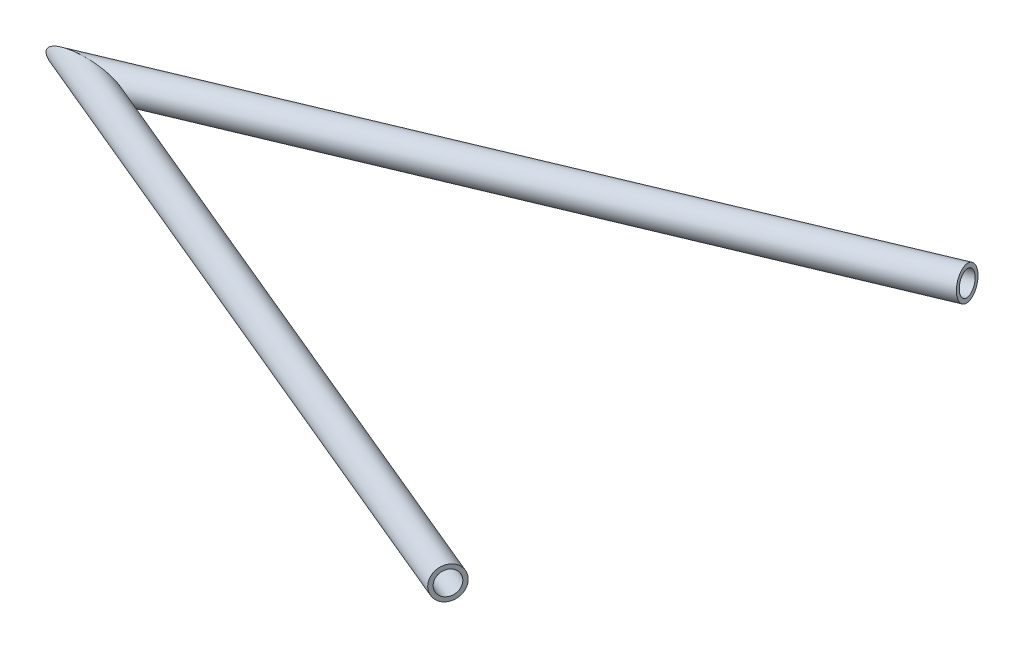
ISO-10303-21;
HEADER;
FILE_DESCRIPTION(('STEP AP214'),'2;1');
FILE_NAME('part.step','',(''),(''),'','','');
FILE_SCHEMA(('AUTOMOTIVE_DESIGN { 1 0 10303 214 1 1 1 1 }'));
ENDSEC;
DATA;
#1=APPLICATION_CONTEXT('core data for automotive mechanical design processes');
#2=APPLICATION_PROTOCOL_DEFINITION('international standard','automotive_design',2000,#1);
#3=PRODUCT_CONTEXT('',#1,'mechanical');
#4=PRODUCT('Part','Part','',(#3));
#5=PRODUCT_RELATED_PRODUCT_CATEGORY('part','',(#4));
#6=PRODUCT_DEFINITION_FORMATION('','',#4);
#7=PRODUCT_DEFINITION_CONTEXT('part definition',#1,'design');
#8=PRODUCT_DEFINITION('design','',#6,#7);
#9=PRODUCT_DEFINITION_SHAPE('','',#8);
#10=(LENGTH_UNIT() NAMED_UNIT(*) SI_UNIT(.MILLI.,.METRE.));
#11=(NAMED_UNIT(*) PLANE_ANGLE_UNIT() SI_UNIT($,.RADIAN.));
#12=(NAMED_UNIT(*) SI_UNIT($,.STERADIAN.) SOLID_ANGLE_UNIT());
#13=UNCERTAINTY_MEASURE_WITH_UNIT(LENGTH_MEASURE(1.E-05),#10,'distance_accuracy_value','');
#14=(GEOMETRIC_REPRESENTATION_CONTEXT(3) GLOBAL_UNCERTAINTY_ASSIGNED_CONTEXT((#13)) GLOBAL_UNIT_ASSIGNED_CONTEXT((#10,
#11,#12)) REPRESENTATION_CONTEXT('',''));
#15=CARTESIAN_POINT('',(0.,0.,0.));
#16=DIRECTION('',(0.,0.,1.));
#17=DIRECTION('',(1.,0.,0.));
#18=AXIS2_PLACEMENT_3D('',#15,#16,#17);
#19=CARTESIAN_POINT('',(1.0874148288198,3.28807163989543,0.));
#20=DIRECTION('',(0.898855963998812,0.0924161876480376,0.428389080444832));
#21=DIRECTION('',(0.430230265092592,0.,-0.902719180586276));
#22=AXIS2_PLACEMENT_3D('',#19,#20,#21);
#23=CYLINDRICAL_SURFACE('',#22,6.985);
#24=CARTESIAN_POINT('',(435.,47.9009445585179,206.799999999963));
#25=DIRECTION('',(-0.898855963998812,-0.0924161876480376,-0.428389080444832));
#26=DIRECTION('',(-0.428745612601026,-0.0169737694915591,0.903265791904364));
#27=AXIS2_PLACEMENT_3D('',#24,#25,#26);
#28=CIRCLE('',#27,6.985);
#29=CARTESIAN_POINT('',(432.005211895982,47.7823827786193,213.109311556415));
#30=VERTEX_POINT('',#29);
#31=EDGE_CURVE('E62',#30,#30,#28,.T.);
#32=ORIENTED_EDGE('',*,*,#31,.F.);
#33=EDGE_LOOP('',(#32));
#34=FACE_BOUND('',#33,.T.);
#35=CARTESIAN_POINT('',(1.08741482881999,3.28807163989544,0.));
#36=DIRECTION('',(0.0880366075697118,0.00905151433702898,-0.996076114469082));
#37=DIRECTION('',(0.990852732362575,0.10187486729043,0.0885007016027381));
#38=AXIS2_PLACEMENT_3D('',#35,#36,#37);
#39=ELLIPSE('',#38,20.1448122434858,6.985);
#40=CARTESIAN_POINT('',(21.0479570832089,5.34032171379119,1.78283001720398));
#41=VERTEX_POINT('',#40);
#42=EDGE_CURVE('E58',#41,#41,#39,.T.);
#43=ORIENTED_EDGE('',*,*,#42,.T.);
#44=EDGE_LOOP('',(#43));
#45=FACE_BOUND('',#44,.T.);
#46=ADVANCED_FACE('F54',(#34,#45),#23,.F.);
#47=CARTESIAN_POINT('',(1.0874148288198,3.28807163989543,0.));
#48=DIRECTION('',(0.898855963998812,0.0924161876480376,0.428389080444832));
#49=DIRECTION('',(0.430230265092592,0.,-0.902719180586276));
#50=AXIS2_PLACEMENT_3D('',#47,#48,#49);
#51=CYLINDRICAL_SURFACE('',#50,9.525);
#52=CARTESIAN_POINT('',(435.,47.9009445585179,206.799999999963));
#53=DIRECTION('',(-0.898855963998812,-0.0924161876480376,-0.428389080444832));
#54=DIRECTION('',(-0.428745612601026,-0.0169737694915591,0.903265791904364));
#55=AXIS2_PLACEMENT_3D('',#52,#53,#54);
#56=CIRCLE('',#55,9.525);
#57=CARTESIAN_POINT('',(430.916198039975,47.7392694041108,215.403606667852));
#58=VERTEX_POINT('',#57);
#59=EDGE_CURVE('E66',#58,#58,#56,.T.);
#60=ORIENTED_EDGE('',*,*,#59,.T.);
#61=EDGE_LOOP('',(#60));
#62=FACE_BOUND('',#61,.T.);
#63=CARTESIAN_POINT('',(1.08741482881999,3.28807163989544,0.));
#64=DIRECTION('',(0.0880366075697118,0.00905151433702898,-0.996076114469082));
#65=DIRECTION('',(0.990852732362575,0.10187486729043,0.0885007016027381));
#66=AXIS2_PLACEMENT_3D('',#63,#64,#65);
#67=ELLIPSE('',#66,27.4701985138442,9.525);
#68=CARTESIAN_POINT('',(28.3063360848049,6.08659446793509,2.43113184164177));
#69=VERTEX_POINT('',#68);
#70=EDGE_CURVE('E12',#69,#69,#67,.T.);
#71=ORIENTED_EDGE('',*,*,#70,.F.);
#72=EDGE_LOOP('',(#71));
#73=FACE_BOUND('',#72,.T.);
#74=ADVANCED_FACE('F81',(#62,#73),#51,.T.);
#75=CARTESIAN_POINT('',(435.,47.9009445585179,206.799999999963));
#76=DIRECTION('',(-0.898855963998812,-0.0924161876480376,-0.428389080444832));
#77=DIRECTION('',(-0.428745612601026,-0.0169737694915591,0.903265791904364));
#78=AXIS2_PLACEMENT_3D('',#75,#76,#77);
#79=PLANE('',#78);
#80=ORIENTED_EDGE('',*,*,#31,.T.);
#81=EDGE_LOOP('',(#80));
#82=FACE_BOUND('',#81,.T.);
#83=ORIENTED_EDGE('',*,*,#59,.F.);
#84=EDGE_LOOP('',(#83));
#85=FACE_BOUND('',#84,.T.);
#86=ADVANCED_FACE('F77',(#82,#85),#79,.F.);
#87=CARTESIAN_POINT('',(1.08741482881979,3.28807163989544,0.));
#88=DIRECTION('',(0.0880366075697118,0.00905151433702898,-0.996076114469082));
#89=DIRECTION('',(-0.996116921190666,0.,-0.0880402142070784));
#90=AXIS2_PLACEMENT_3D('',#87,#88,#89);
#91=PLANE('',#90);
#92=ORIENTED_EDGE('',*,*,#42,.F.);
#93=EDGE_LOOP('',(#92));
#94=FACE_BOUND('',#93,.T.);
#95=ORIENTED_EDGE('',*,*,#70,.T.);
#96=EDGE_LOOP('',(#95));
#97=FACE_BOUND('',#96,.T.);
#98=ADVANCED_FACE('F56',(#94,#97),#91,.T.);
#99=CLOSED_SHELL('',(#46,#74,#86,#98));
#100=MANIFOLD_SOLID_BREP('B2',#99);
#101=CARTESIAN_POINT('',(435.,47.9009445585179,-118.600000000036));
#102=DIRECTION('',(-0.959907484007224,-0.0986932208494359,0.26236857720635));
#103=DIRECTION('',(0.263655769281215,0.,0.964616833423889));
#104=AXIS2_PLACEMENT_3D('',#101,#102,#103);
#105=CYLINDRICAL_SURFACE('',#104,6.985);
#106=CARTESIAN_POINT('',(435.,47.9009445585179,-118.600000000036));
#107=DIRECTION('',(0.959907484007224,0.0986932208494359,-0.26236857720635));
#108=DIRECTION('',(-0.263655769281215,0.,-0.964616833423889));
#109=AXIS2_PLACEMENT_3D('',#106,#107,#108);
#110=CIRCLE('',#109,6.985);
#111=CARTESIAN_POINT('',(433.158364451571,47.9009445585179,-125.337848581502));
#112=VERTEX_POINT('',#111);
#113=EDGE_CURVE('E158',#112,#112,#110,.T.);
#114=ORIENTED_EDGE('',*,*,#113,.T.);
#115=EDGE_LOOP('',(#114));
#116=FACE_BOUND('',#115,.T.);
#117=CARTESIAN_POINT('',(1.08741482881985,3.28807163989545,0.));
#118=DIRECTION('',(-0.0880366075697121,-0.00905151433702901,0.996076114469082));
#119=DIRECTION('',(-0.990852732362575,-0.10187486729043,-0.0885007016027383));
#120=AXIS2_PLACEMENT_3D('',#117,#118,#119);
#121=ELLIPSE('',#120,20.1448122434857,6.985);
#122=CARTESIAN_POINT('',(-18.8731274255691,1.23582156599971,-1.78283001720389));
#123=VERTEX_POINT('',#122);
#124=EDGE_CURVE('E148',#123,#123,#121,.T.);
#125=ORIENTED_EDGE('',*,*,#124,.T.);
#126=EDGE_LOOP('',(#125));
#127=FACE_BOUND('',#126,.T.);
#128=ADVANCED_FACE('F144',(#116,#127),#105,.F.);
#129=CARTESIAN_POINT('',(435.,47.9009445585179,-118.600000000036));
#130=DIRECTION('',(-0.959907484007224,-0.0986932208494359,0.26236857720635));
#131=DIRECTION('',(0.263655769281215,0.,0.964616833423889));
#132=AXIS2_PLACEMENT_3D('',#129,#130,#131);
#133=CYLINDRICAL_SURFACE('',#132,9.525);
#134=CARTESIAN_POINT('',(435.,47.9009445585179,-118.600000000036));
#135=DIRECTION('',(0.959907484007224,0.0986932208494359,-0.26236857720635));
#136=DIRECTION('',(-0.263655769281215,0.,-0.964616833423889));
#137=AXIS2_PLACEMENT_3D('',#134,#135,#136);
#138=CIRCLE('',#137,9.525);
#139=CARTESIAN_POINT('',(432.488678797596,47.9009445585179,-127.787975338399));
#140=VERTEX_POINT('',#139);
#141=EDGE_CURVE('E152',#140,#140,#138,.T.);
#142=ORIENTED_EDGE('',*,*,#141,.F.);
#143=EDGE_LOOP('',(#142));
#144=FACE_BOUND('',#143,.T.);
#145=CARTESIAN_POINT('',(1.08741482881985,3.28807163989545,0.));
#146=DIRECTION('',(-0.0880366075697121,-0.00905151433702901,0.996076114469082));
#147=DIRECTION('',(-0.990852732362575,-0.10187486729043,-0.0885007016027383));
#148=AXIS2_PLACEMENT_3D('',#145,#146,#147);
#149=ELLIPSE('',#148,27.4701985138442,9.525);
#150=CARTESIAN_POINT('',(-26.131506427165,0.489548811855799,-2.43113184164168));
#151=VERTEX_POINT('',#150);
#152=EDGE_CURVE('E53',#151,#151,#149,.T.);
#153=ORIENTED_EDGE('',*,*,#152,.F.);
#154=EDGE_LOOP('',(#153));
#155=FACE_BOUND('',#154,.T.);
#156=ADVANCED_FACE('F171',(#144,#155),#133,.T.);
#157=CARTESIAN_POINT('',(435.,47.9009445585179,-118.600000000036));
#158=DIRECTION('',(0.959907484007224,0.0986932208494359,-0.26236857720635));
#159=DIRECTION('',(-0.263655769281215,0.,-0.964616833423889));
#160=AXIS2_PLACEMENT_3D('',#157,#158,#159);
#161=PLANE('',#160);
#162=ORIENTED_EDGE('',*,*,#113,.F.);
#163=EDGE_LOOP('',(#162));
#164=FACE_BOUND('',#163,.T.);
#165=ORIENTED_EDGE('',*,*,#141,.T.);
#166=EDGE_LOOP('',(#165));
#167=FACE_BOUND('',#166,.T.);
#168=ADVANCED_FACE('F167',(#164,#167),#161,.T.);
#169=CARTESIAN_POINT('',(1.08741482881979,3.28807163989544,0.));
#170=DIRECTION('',(-0.0880366075697121,-0.00905151433702901,0.996076114469082));
#171=DIRECTION('',(0.996116921190666,0.,0.0880402142070786));
#172=AXIS2_PLACEMENT_3D('',#169,#170,#171);
#173=PLANE('',#172);
#174=ORIENTED_EDGE('',*,*,#124,.F.);
#175=EDGE_LOOP('',(#174));
#176=FACE_BOUND('',#175,.T.);
#177=ORIENTED_EDGE('',*,*,#152,.T.);
#178=EDGE_LOOP('',(#177));
#179=FACE_BOUND('',#178,.T.);
#180=ADVANCED_FACE('F146',(#176,#179),#173,.T.);
#181=CLOSED_SHELL('',(#128,#156,#168,#180));
#182=MANIFOLD_SOLID_BREP('B7',#181);
#183=ADVANCED_BREP_SHAPE_REPRESENTATION('',(#18,#100,#182),#14);
#184=SHAPE_DEFINITION_REPRESENTATION(#9,#183);
ENDSEC;
END-ISO-10303-21;
